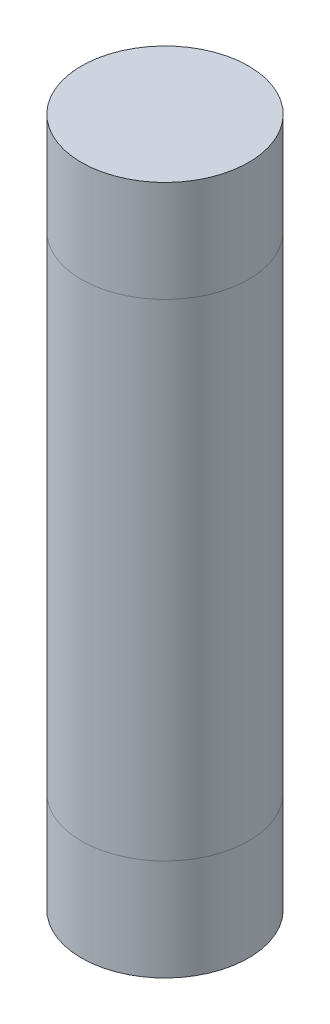
ISO-10303-21;
HEADER;
FILE_DESCRIPTION(('STEP AP214'),'2;1');
FILE_NAME('part.step','',(''),(''),'','','');
FILE_SCHEMA(('AUTOMOTIVE_DESIGN { 1 0 10303 214 1 1 1 1 }'));
ENDSEC;
DATA;
#1=APPLICATION_CONTEXT('core data for automotive mechanical design processes');
#2=APPLICATION_PROTOCOL_DEFINITION('international standard','automotive_design',2000,#1);
#3=PRODUCT_CONTEXT('',#1,'mechanical');
#4=PRODUCT('Part','Part','',(#3));
#5=PRODUCT_RELATED_PRODUCT_CATEGORY('part','',(#4));
#6=PRODUCT_DEFINITION_FORMATION('','',#4);
#7=PRODUCT_DEFINITION_CONTEXT('part definition',#1,'design');
#8=PRODUCT_DEFINITION('design','',#6,#7);
#9=PRODUCT_DEFINITION_SHAPE('','',#8);
#10=(LENGTH_UNIT() NAMED_UNIT(*) SI_UNIT(.MILLI.,.METRE.));
#11=(NAMED_UNIT(*) PLANE_ANGLE_UNIT() SI_UNIT($,.RADIAN.));
#12=(NAMED_UNIT(*) SI_UNIT($,.STERADIAN.) SOLID_ANGLE_UNIT());
#13=UNCERTAINTY_MEASURE_WITH_UNIT(LENGTH_MEASURE(1.E-05),#10,'distance_accuracy_value','');
#14=(GEOMETRIC_REPRESENTATION_CONTEXT(3) GLOBAL_UNCERTAINTY_ASSIGNED_CONTEXT((#13)) GLOBAL_UNIT_ASSIGNED_CONTEXT((#10,
#11,#12)) REPRESENTATION_CONTEXT('',''));
#15=CARTESIAN_POINT('',(0.,0.,0.));
#16=DIRECTION('',(0.,0.,1.));
#17=DIRECTION('',(1.,0.,0.));
#18=AXIS2_PLACEMENT_3D('',#15,#16,#17);
#19=CARTESIAN_POINT('',(0.,68.,0.));
#20=DIRECTION('',(0.,-1.,0.));
#21=DIRECTION('',(0.,0.,-1.));
#22=AXIS2_PLACEMENT_3D('',#19,#20,#21);
#23=CYLINDRICAL_SURFACE('',#22,8.25);
#24=CARTESIAN_POINT('',(0.,68.,0.));
#25=DIRECTION('',(0.,1.,0.));
#26=DIRECTION('',(0.,0.,1.));
#27=AXIS2_PLACEMENT_3D('',#24,#25,#26);
#28=CIRCLE('',#27,8.25);
#29=CARTESIAN_POINT('',(0.,68.,8.25));
#30=VERTEX_POINT('',#29);
#31=EDGE_CURVE('E11',#30,#30,#28,.T.);
#32=ORIENTED_EDGE('',*,*,#31,.F.);
#33=EDGE_LOOP('',(#32));
#34=FACE_BOUND('',#33,.T.);
#35=CARTESIAN_POINT('',(0.,58.,0.));
#36=DIRECTION('',(0.,1.,0.));
#37=DIRECTION('',(0.,0.,1.));
#38=AXIS2_PLACEMENT_3D('',#35,#36,#37);
#39=CIRCLE('',#38,8.25);
#40=CARTESIAN_POINT('',(0.,58.,8.25));
#41=VERTEX_POINT('',#40);
#42=EDGE_CURVE('E47',#41,#41,#39,.T.);
#43=ORIENTED_EDGE('',*,*,#42,.T.);
#44=EDGE_LOOP('',(#43));
#45=FACE_BOUND('',#44,.T.);
#46=ADVANCED_FACE('F44',(#34,#45),#23,.T.);
#47=CARTESIAN_POINT('',(0.,68.,0.));
#48=DIRECTION('',(0.,1.,0.));
#49=DIRECTION('',(0.,0.,1.));
#50=AXIS2_PLACEMENT_3D('',#47,#48,#49);
#51=PLANE('',#50);
#52=ORIENTED_EDGE('',*,*,#31,.T.);
#53=EDGE_LOOP('',(#52));
#54=FACE_BOUND('',#53,.T.);
#55=ADVANCED_FACE('F59',(#54),#51,.T.);
#56=CARTESIAN_POINT('',(0.,58.,0.));
#57=DIRECTION('',(0.,1.,0.));
#58=DIRECTION('',(0.,0.,1.));
#59=AXIS2_PLACEMENT_3D('',#56,#57,#58);
#60=PLANE('',#59);
#61=ORIENTED_EDGE('',*,*,#42,.F.);
#62=EDGE_LOOP('',(#61));
#63=FACE_BOUND('',#62,.T.);
#64=ADVANCED_FACE('F57',(#63),#60,.F.);
#65=CLOSED_SHELL('',(#46,#55,#64));
#66=MANIFOLD_SOLID_BREP('B2',#65);
#67=CARTESIAN_POINT('',(0.,58.,0.));
#68=DIRECTION('',(0.,-1.,0.));
#69=DIRECTION('',(0.,0.,-1.));
#70=AXIS2_PLACEMENT_3D('',#67,#68,#69);
#71=CYLINDRICAL_SURFACE('',#70,8.25);
#72=CARTESIAN_POINT('',(0.,58.,0.));
#73=DIRECTION('',(0.,1.,0.));
#74=DIRECTION('',(0.,0.,1.));
#75=AXIS2_PLACEMENT_3D('',#72,#73,#74);
#76=CIRCLE('',#75,8.25);
#77=CARTESIAN_POINT('',(0.,58.,8.25));
#78=VERTEX_POINT('',#77);
#79=EDGE_CURVE('E43',#78,#78,#76,.T.);
#80=ORIENTED_EDGE('',*,*,#79,.F.);
#81=EDGE_LOOP('',(#80));
#82=FACE_BOUND('',#81,.T.);
#83=CARTESIAN_POINT('',(0.,10.,0.));
#84=DIRECTION('',(0.,1.,0.));
#85=DIRECTION('',(0.,0.,1.));
#86=AXIS2_PLACEMENT_3D('',#83,#84,#85);
#87=CIRCLE('',#86,8.25);
#88=CARTESIAN_POINT('',(0.,10.,8.25));
#89=VERTEX_POINT('',#88);
#90=EDGE_CURVE('E95',#89,#89,#87,.T.);
#91=ORIENTED_EDGE('',*,*,#90,.T.);
#92=EDGE_LOOP('',(#91));
#93=FACE_BOUND('',#92,.T.);
#94=ADVANCED_FACE('F92',(#82,#93),#71,.T.);
#95=CARTESIAN_POINT('',(0.,58.,0.));
#96=DIRECTION('',(0.,1.,0.));
#97=DIRECTION('',(0.,0.,1.));
#98=AXIS2_PLACEMENT_3D('',#95,#96,#97);
#99=PLANE('',#98);
#100=ORIENTED_EDGE('',*,*,#79,.T.);
#101=EDGE_LOOP('',(#100));
#102=FACE_BOUND('',#101,.T.);
#103=ADVANCED_FACE('F107',(#102),#99,.T.);
#104=CARTESIAN_POINT('',(0.,10.,0.));
#105=DIRECTION('',(0.,1.,0.));
#106=DIRECTION('',(0.,0.,1.));
#107=AXIS2_PLACEMENT_3D('',#104,#105,#106);
#108=PLANE('',#107);
#109=ORIENTED_EDGE('',*,*,#90,.F.);
#110=EDGE_LOOP('',(#109));
#111=FACE_BOUND('',#110,.T.);
#112=ADVANCED_FACE('F105',(#111),#108,.F.);
#113=CLOSED_SHELL('',(#94,#103,#112));
#114=MANIFOLD_SOLID_BREP('B6',#113);
#115=CARTESIAN_POINT('',(0.,10.,0.));
#116=DIRECTION('',(0.,-1.,0.));
#117=DIRECTION('',(0.,0.,-1.));
#118=AXIS2_PLACEMENT_3D('',#115,#116,#117);
#119=CYLINDRICAL_SURFACE('',#118,8.25);
#120=CARTESIAN_POINT('',(0.,10.,0.));
#121=DIRECTION('',(0.,1.,0.));
#122=DIRECTION('',(0.,0.,1.));
#123=AXIS2_PLACEMENT_3D('',#120,#121,#122);
#124=CIRCLE('',#123,8.25);
#125=CARTESIAN_POINT('',(0.,10.,8.25));
#126=VERTEX_POINT('',#125);
#127=EDGE_CURVE('E91',#126,#126,#124,.T.);
#128=ORIENTED_EDGE('',*,*,#127,.F.);
#129=EDGE_LOOP('',(#128));
#130=FACE_BOUND('',#129,.T.);
#131=CARTESIAN_POINT('',(0.,0.,0.));
#132=DIRECTION('',(0.,1.,0.));
#133=DIRECTION('',(0.,0.,1.));
#134=AXIS2_PLACEMENT_3D('',#131,#132,#133);
#135=CIRCLE('',#134,8.25);
#136=CARTESIAN_POINT('',(0.,0.,8.25));
#137=VERTEX_POINT('',#136);
#138=EDGE_CURVE('E138',#137,#137,#135,.T.);
#139=ORIENTED_EDGE('',*,*,#138,.T.);
#140=EDGE_LOOP('',(#139));
#141=FACE_BOUND('',#140,.T.);
#142=ADVANCED_FACE('F135',(#130,#141),#119,.T.);
#143=CARTESIAN_POINT('',(0.,10.,0.));
#144=DIRECTION('',(0.,1.,0.));
#145=DIRECTION('',(0.,0.,1.));
#146=AXIS2_PLACEMENT_3D('',#143,#144,#145);
#147=PLANE('',#146);
#148=ORIENTED_EDGE('',*,*,#127,.T.);
#149=EDGE_LOOP('',(#148));
#150=FACE_BOUND('',#149,.T.);
#151=ADVANCED_FACE('F150',(#150),#147,.T.);
#152=CARTESIAN_POINT('',(0.,0.,0.));
#153=DIRECTION('',(0.,1.,0.));
#154=DIRECTION('',(0.,0.,1.));
#155=AXIS2_PLACEMENT_3D('',#152,#153,#154);
#156=PLANE('',#155);
#157=ORIENTED_EDGE('',*,*,#138,.F.);
#158=EDGE_LOOP('',(#157));
#159=FACE_BOUND('',#158,.T.);
#160=ADVANCED_FACE('F148',(#159),#156,.F.);
#161=CLOSED_SHELL('',(#142,#151,#160));
#162=MANIFOLD_SOLID_BREP('B38',#161);
#163=ADVANCED_BREP_SHAPE_REPRESENTATION('',(#18,#66,#114,#162),#14);
#164=SHAPE_DEFINITION_REPRESENTATION(#9,#163);
ENDSEC;
END-ISO-10303-21;
